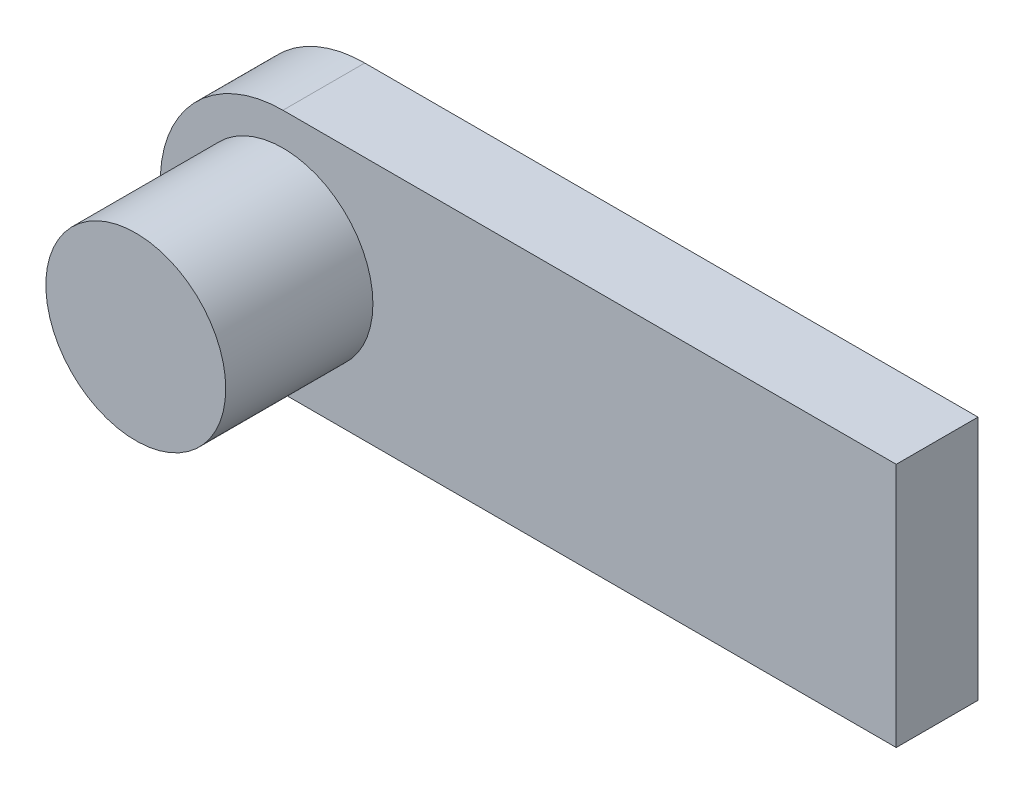
ISO-10303-21;
HEADER;
FILE_DESCRIPTION(('STEP AP214'),'2;1');
FILE_NAME('part.step','',(''),(''),'','','');
FILE_SCHEMA(('AUTOMOTIVE_DESIGN { 1 0 10303 214 1 1 1 1 }'));
ENDSEC;
DATA;
#1=APPLICATION_CONTEXT('core data for automotive mechanical design processes');
#2=APPLICATION_PROTOCOL_DEFINITION('international standard','automotive_design',2000,#1);
#3=PRODUCT_CONTEXT('',#1,'mechanical');
#4=PRODUCT('Part','Part','',(#3));
#5=PRODUCT_RELATED_PRODUCT_CATEGORY('part','',(#4));
#6=PRODUCT_DEFINITION_FORMATION('','',#4);
#7=PRODUCT_DEFINITION_CONTEXT('part definition',#1,'design');
#8=PRODUCT_DEFINITION('design','',#6,#7);
#9=PRODUCT_DEFINITION_SHAPE('','',#8);
#10=(LENGTH_UNIT() NAMED_UNIT(*) SI_UNIT(.MILLI.,.METRE.));
#11=(NAMED_UNIT(*) PLANE_ANGLE_UNIT() SI_UNIT($,.RADIAN.));
#12=(NAMED_UNIT(*) SI_UNIT($,.STERADIAN.) SOLID_ANGLE_UNIT());
#13=UNCERTAINTY_MEASURE_WITH_UNIT(LENGTH_MEASURE(1.E-05),#10,'distance_accuracy_value','');
#14=(GEOMETRIC_REPRESENTATION_CONTEXT(3) GLOBAL_UNCERTAINTY_ASSIGNED_CONTEXT((#13)) GLOBAL_UNIT_ASSIGNED_CONTEXT((#10,
#11,#12)) REPRESENTATION_CONTEXT('',''));
#15=CARTESIAN_POINT('',(0.,0.,0.));
#16=DIRECTION('',(0.,0.,1.));
#17=DIRECTION('',(1.,0.,0.));
#18=AXIS2_PLACEMENT_3D('',#15,#16,#17);
#19=CARTESIAN_POINT('',(0.,0.,0.25));
#20=DIRECTION('',(0.,0.,1.));
#21=DIRECTION('',(0.707106781186548,0.707106781186548,0.));
#22=AXIS2_PLACEMENT_3D('',#19,#20,#21);
#23=PLANE('',#22);
#24=DIRECTION('',(0.,1.,0.));
#25=VECTOR('',#24,1.);
#26=CARTESIAN_POINT('',(4.55,-0.375,0.25));
#27=LINE('',#26,#25);
#28=CARTESIAN_POINT('',(4.55,-0.375,0.25));
#29=VERTEX_POINT('',#28);
#30=CARTESIAN_POINT('',(4.55,0.375,0.25));
#31=VERTEX_POINT('',#30);
#32=EDGE_CURVE('E11',#29,#31,#27,.T.);
#33=ORIENTED_EDGE('',*,*,#32,.T.);
#34=DIRECTION('',(-1.,0.,0.));
#35=VECTOR('',#34,1.);
#36=CARTESIAN_POINT('',(4.55,0.375,0.25));
#37=LINE('',#36,#35);
#38=CARTESIAN_POINT('',(2.675,0.375,0.25));
#39=VERTEX_POINT('',#38);
#40=EDGE_CURVE('E26',#31,#39,#37,.T.);
#41=ORIENTED_EDGE('',*,*,#40,.T.);
#42=CARTESIAN_POINT('',(2.675,0.,0.25));
#43=DIRECTION('',(0.,0.,1.));
#44=DIRECTION('',(0.,1.,0.));
#45=AXIS2_PLACEMENT_3D('',#42,#43,#44);
#46=CIRCLE('',#45,0.375);
#47=CARTESIAN_POINT('',(2.675,-0.375,0.25));
#48=VERTEX_POINT('',#47);
#49=EDGE_CURVE('E104',#39,#48,#46,.T.);
#50=ORIENTED_EDGE('',*,*,#49,.T.);
#51=DIRECTION('',(1.,0.,0.));
#52=VECTOR('',#51,1.);
#53=CARTESIAN_POINT('',(2.675,-0.375,0.25));
#54=LINE('',#53,#52);
#55=EDGE_CURVE('E75',#48,#29,#54,.T.);
#56=ORIENTED_EDGE('',*,*,#55,.T.);
#57=EDGE_LOOP('',(#33,#41,#50,#56));
#58=FACE_BOUND('',#57,.T.);
#59=CARTESIAN_POINT('',(2.675,0.,0.25));
#60=DIRECTION('',(0.,0.,1.));
#61=DIRECTION('',(1.,0.,0.));
#62=AXIS2_PLACEMENT_3D('',#59,#60,#61);
#63=CIRCLE('',#62,0.275);
#64=CARTESIAN_POINT('',(2.95,0.,0.25));
#65=VERTEX_POINT('',#64);
#66=EDGE_CURVE('E66',#65,#65,#63,.T.);
#67=ORIENTED_EDGE('',*,*,#66,.F.);
#68=EDGE_LOOP('',(#67));
#69=FACE_BOUND('',#68,.T.);
#70=ADVANCED_FACE('F16',(#58,#69),#23,.T.);
#71=CARTESIAN_POINT('',(4.55,-0.375,0.));
#72=DIRECTION('',(1.,0.,0.));
#73=DIRECTION('',(0.,0.707106781186548,0.707106781186548));
#74=AXIS2_PLACEMENT_3D('',#71,#72,#73);
#75=PLANE('',#74);
#76=DIRECTION('',(0.,1.,0.));
#77=VECTOR('',#76,1.);
#78=CARTESIAN_POINT('',(4.55,-0.375,0.));
#79=LINE('',#78,#77);
#80=CARTESIAN_POINT('',(4.55,-0.375,0.));
#81=VERTEX_POINT('',#80);
#82=CARTESIAN_POINT('',(4.55,0.375,0.));
#83=VERTEX_POINT('',#82);
#84=EDGE_CURVE('E77',#81,#83,#79,.T.);
#85=ORIENTED_EDGE('',*,*,#84,.T.);
#86=DIRECTION('',(0.,0.,1.));
#87=VECTOR('',#86,1.);
#88=CARTESIAN_POINT('',(4.55,0.375,0.));
#89=LINE('',#88,#87);
#90=EDGE_CURVE('E80',#83,#31,#89,.T.);
#91=ORIENTED_EDGE('',*,*,#90,.T.);
#92=ORIENTED_EDGE('',*,*,#32,.F.);
#93=DIRECTION('',(0.,0.,1.));
#94=VECTOR('',#93,1.);
#95=CARTESIAN_POINT('',(4.55,-0.375,0.));
#96=LINE('',#95,#94);
#97=EDGE_CURVE('E68',#81,#29,#96,.T.);
#98=ORIENTED_EDGE('',*,*,#97,.F.);
#99=EDGE_LOOP('',(#85,#91,#92,#98));
#100=FACE_BOUND('',#99,.T.);
#101=ADVANCED_FACE('F98',(#100),#75,.T.);
#102=CARTESIAN_POINT('',(4.55,0.375,0.));
#103=DIRECTION('',(0.,1.,0.));
#104=DIRECTION('',(0.707106781186548,0.,0.707106781186548));
#105=AXIS2_PLACEMENT_3D('',#102,#103,#104);
#106=PLANE('',#105);
#107=DIRECTION('',(-1.,0.,0.));
#108=VECTOR('',#107,1.);
#109=CARTESIAN_POINT('',(4.55,0.375,0.));
#110=LINE('',#109,#108);
#111=CARTESIAN_POINT('',(2.675,0.375,0.));
#112=VERTEX_POINT('',#111);
#113=EDGE_CURVE('E82',#83,#112,#110,.T.);
#114=ORIENTED_EDGE('',*,*,#113,.T.);
#115=DIRECTION('',(0.,0.,1.));
#116=VECTOR('',#115,1.);
#117=CARTESIAN_POINT('',(2.675,0.375,0.));
#118=LINE('',#117,#116);
#119=EDGE_CURVE('E86',#112,#39,#118,.T.);
#120=ORIENTED_EDGE('',*,*,#119,.T.);
#121=ORIENTED_EDGE('',*,*,#40,.F.);
#122=ORIENTED_EDGE('',*,*,#90,.F.);
#123=EDGE_LOOP('',(#114,#120,#121,#122));
#124=FACE_BOUND('',#123,.T.);
#125=ADVANCED_FACE('F108',(#124),#106,.T.);
#126=CARTESIAN_POINT('',(2.675,0.,0.));
#127=DIRECTION('',(0.,0.,1.));
#128=DIRECTION('',(0.,1.,0.));
#129=AXIS2_PLACEMENT_3D('',#126,#127,#128);
#130=CYLINDRICAL_SURFACE('',#129,0.375);
#131=CARTESIAN_POINT('',(2.675,0.,0.));
#132=DIRECTION('',(0.,0.,1.));
#133=DIRECTION('',(0.,1.,0.));
#134=AXIS2_PLACEMENT_3D('',#131,#132,#133);
#135=CIRCLE('',#134,0.375);
#136=CARTESIAN_POINT('',(2.675,-0.375,0.));
#137=VERTEX_POINT('',#136);
#138=EDGE_CURVE('E88',#112,#137,#135,.T.);
#139=ORIENTED_EDGE('',*,*,#138,.T.);
#140=DIRECTION('',(0.,0.,1.));
#141=VECTOR('',#140,1.);
#142=CARTESIAN_POINT('',(2.675,-0.375,0.));
#143=LINE('',#142,#141);
#144=EDGE_CURVE('E58',#137,#48,#143,.T.);
#145=ORIENTED_EDGE('',*,*,#144,.T.);
#146=ORIENTED_EDGE('',*,*,#49,.F.);
#147=ORIENTED_EDGE('',*,*,#119,.F.);
#148=EDGE_LOOP('',(#139,#145,#146,#147));
#149=FACE_BOUND('',#148,.T.);
#150=ADVANCED_FACE('F107',(#149),#130,.T.);
#151=CARTESIAN_POINT('',(2.675,-0.375,0.));
#152=DIRECTION('',(0.,-1.,0.));
#153=DIRECTION('',(0.707106781186548,0.,0.707106781186548));
#154=AXIS2_PLACEMENT_3D('',#151,#152,#153);
#155=PLANE('',#154);
#156=DIRECTION('',(1.,0.,0.));
#157=VECTOR('',#156,1.);
#158=CARTESIAN_POINT('',(2.675,-0.375,0.));
#159=LINE('',#158,#157);
#160=EDGE_CURVE('E71',#137,#81,#159,.T.);
#161=ORIENTED_EDGE('',*,*,#160,.T.);
#162=ORIENTED_EDGE('',*,*,#97,.T.);
#163=ORIENTED_EDGE('',*,*,#55,.F.);
#164=ORIENTED_EDGE('',*,*,#144,.F.);
#165=EDGE_LOOP('',(#161,#162,#163,#164));
#166=FACE_BOUND('',#165,.T.);
#167=ADVANCED_FACE('F91',(#166),#155,.T.);
#168=CARTESIAN_POINT('',(2.675,0.,0.25));
#169=DIRECTION('',(0.,0.,1.));
#170=DIRECTION('',(1.,0.,0.));
#171=AXIS2_PLACEMENT_3D('',#168,#169,#170);
#172=CYLINDRICAL_SURFACE('',#171,0.275);
#173=CARTESIAN_POINT('',(2.675,0.,0.7));
#174=DIRECTION('',(0.,0.,1.));
#175=DIRECTION('',(1.,0.,0.));
#176=AXIS2_PLACEMENT_3D('',#173,#174,#175);
#177=CIRCLE('',#176,0.275);
#178=CARTESIAN_POINT('',(2.95,0.,0.7));
#179=VERTEX_POINT('',#178);
#180=EDGE_CURVE('E20',#179,#179,#177,.T.);
#181=ORIENTED_EDGE('',*,*,#180,.F.);
#182=EDGE_LOOP('',(#181));
#183=FACE_BOUND('',#182,.T.);
#184=ORIENTED_EDGE('',*,*,#66,.T.);
#185=EDGE_LOOP('',(#184));
#186=FACE_BOUND('',#185,.T.);
#187=ADVANCED_FACE('F63',(#183,#186),#172,.T.);
#188=CARTESIAN_POINT('',(0.,0.,0.));
#189=DIRECTION('',(0.,0.,1.));
#190=DIRECTION('',(0.707106781186548,0.707106781186548,0.));
#191=AXIS2_PLACEMENT_3D('',#188,#189,#190);
#192=PLANE('',#191);
#193=ORIENTED_EDGE('',*,*,#160,.F.);
#194=ORIENTED_EDGE('',*,*,#138,.F.);
#195=ORIENTED_EDGE('',*,*,#113,.F.);
#196=ORIENTED_EDGE('',*,*,#84,.F.);
#197=EDGE_LOOP('',(#193,#194,#195,#196));
#198=FACE_BOUND('',#197,.T.);
#199=ADVANCED_FACE('F95',(#198),#192,.F.);
#200=CARTESIAN_POINT('',(1.8,0.,0.7));
#201=DIRECTION('',(0.,0.,-1.));
#202=DIRECTION('',(0.707106781186548,0.707106781186548,0.));
#203=AXIS2_PLACEMENT_3D('',#200,#201,#202);
#204=PLANE('',#203);
#205=ORIENTED_EDGE('',*,*,#180,.T.);
#206=EDGE_LOOP('',(#205));
#207=FACE_BOUND('',#206,.T.);
#208=ADVANCED_FACE('F18',(#207),#204,.F.);
#209=CLOSED_SHELL('',(#70,#101,#125,#150,#167,#187,#199,#208));
#210=MANIFOLD_SOLID_BREP('B1',#209);
#211=ADVANCED_BREP_SHAPE_REPRESENTATION('',(#18,#210),#14);
#212=SHAPE_DEFINITION_REPRESENTATION(#9,#211);
ENDSEC;
END-ISO-10303-21;
